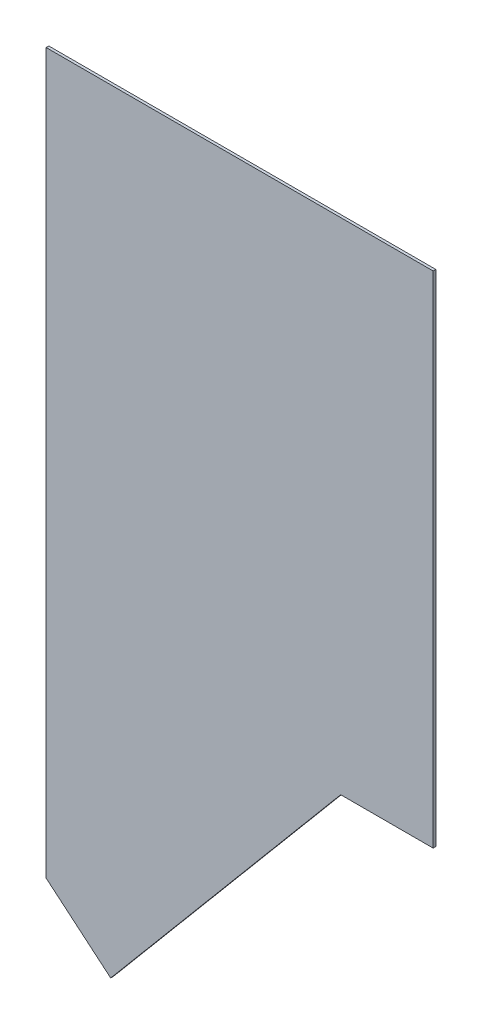
ISO-10303-21;
HEADER;
FILE_DESCRIPTION(('STEP AP214'),'2;1');
FILE_NAME('part.step','',(''),(''),'','','');
FILE_SCHEMA(('AUTOMOTIVE_DESIGN { 1 0 10303 214 1 1 1 1 }'));
ENDSEC;
DATA;
#1=APPLICATION_CONTEXT('core data for automotive mechanical design processes');
#2=APPLICATION_PROTOCOL_DEFINITION('international standard','automotive_design',2000,#1);
#3=PRODUCT_CONTEXT('',#1,'mechanical');
#4=PRODUCT('Part','Part','',(#3));
#5=PRODUCT_RELATED_PRODUCT_CATEGORY('part','',(#4));
#6=PRODUCT_DEFINITION_FORMATION('','',#4);
#7=PRODUCT_DEFINITION_CONTEXT('part definition',#1,'design');
#8=PRODUCT_DEFINITION('design','',#6,#7);
#9=PRODUCT_DEFINITION_SHAPE('','',#8);
#10=(LENGTH_UNIT() NAMED_UNIT(*) SI_UNIT(.MILLI.,.METRE.));
#11=(NAMED_UNIT(*) PLANE_ANGLE_UNIT() SI_UNIT($,.RADIAN.));
#12=(NAMED_UNIT(*) SI_UNIT($,.STERADIAN.) SOLID_ANGLE_UNIT());
#13=UNCERTAINTY_MEASURE_WITH_UNIT(LENGTH_MEASURE(1.E-05),#10,'distance_accuracy_value','');
#14=(GEOMETRIC_REPRESENTATION_CONTEXT(3) GLOBAL_UNCERTAINTY_ASSIGNED_CONTEXT((#13)) GLOBAL_UNIT_ASSIGNED_CONTEXT((#10,
#11,#12)) REPRESENTATION_CONTEXT('',''));
#15=CARTESIAN_POINT('',(0.,0.,0.));
#16=DIRECTION('',(0.,0.,1.));
#17=DIRECTION('',(1.,0.,0.));
#18=AXIS2_PLACEMENT_3D('',#15,#16,#17);
#19=CARTESIAN_POINT('',(-50.8,0.,2.1082));
#20=DIRECTION('',(1.,0.,0.));
#21=DIRECTION('',(0.,1.,0.));
#22=AXIS2_PLACEMENT_3D('',#19,#20,#21);
#23=PLANE('',#22);
#24=DIRECTION('',(0.,-1.,0.));
#25=VECTOR('',#24,1.);
#26=CARTESIAN_POINT('',(-50.8,0.,0.));
#27=LINE('',#26,#25);
#28=CARTESIAN_POINT('',(-50.8,0.,0.));
#29=VERTEX_POINT('',#28);
#30=CARTESIAN_POINT('',(-50.7999999999999,-566.618355907721,0.));
#31=VERTEX_POINT('',#30);
#32=EDGE_CURVE('E82',#29,#31,#27,.T.);
#33=ORIENTED_EDGE('',*,*,#32,.T.);
#34=DIRECTION('',(0.,0.,1.));
#35=VECTOR('',#34,1.);
#36=CARTESIAN_POINT('',(-50.7999999999999,-566.618355907721,0.));
#37=LINE('',#36,#35);
#38=CARTESIAN_POINT('',(-50.7999999999999,-566.618355907721,2.1082));
#39=VERTEX_POINT('',#38);
#40=EDGE_CURVE('E87',#31,#39,#37,.T.);
#41=ORIENTED_EDGE('',*,*,#40,.T.);
#42=DIRECTION('',(0.,-1.,0.));
#43=VECTOR('',#42,1.);
#44=CARTESIAN_POINT('',(-50.8,0.,2.1082));
#45=LINE('',#44,#43);
#46=CARTESIAN_POINT('',(-50.8,0.,2.1082));
#47=VERTEX_POINT('',#46);
#48=EDGE_CURVE('E76',#47,#39,#45,.T.);
#49=ORIENTED_EDGE('',*,*,#48,.F.);
#50=DIRECTION('',(0.,0.,-1.));
#51=VECTOR('',#50,1.);
#52=CARTESIAN_POINT('',(-50.8,0.,2.1082));
#53=LINE('',#52,#51);
#54=EDGE_CURVE('E40',#47,#29,#53,.T.);
#55=ORIENTED_EDGE('',*,*,#54,.T.);
#56=EDGE_LOOP('',(#33,#41,#49,#55));
#57=FACE_BOUND('',#56,.T.);
#58=ADVANCED_FACE('F33',(#57),#23,.F.);
#59=CARTESIAN_POINT('',(254.,0.,2.1082));
#60=DIRECTION('',(-1.,0.,0.));
#61=DIRECTION('',(0.,0.,1.));
#62=AXIS2_PLACEMENT_3D('',#59,#60,#61);
#63=PLANE('',#62);
#64=DIRECTION('',(0.,1.,0.));
#65=VECTOR('',#64,1.);
#66=CARTESIAN_POINT('',(254.,0.,2.1082));
#67=LINE('',#66,#65);
#68=CARTESIAN_POINT('',(254.,-393.7,2.1082));
#69=VERTEX_POINT('',#68);
#70=CARTESIAN_POINT('',(254.,0.,2.1082));
#71=VERTEX_POINT('',#70);
#72=EDGE_CURVE('E94',#69,#71,#67,.T.);
#73=ORIENTED_EDGE('',*,*,#72,.F.);
#74=DIRECTION('',(0.,0.,1.));
#75=VECTOR('',#74,1.);
#76=CARTESIAN_POINT('',(254.,-393.7,0.));
#77=LINE('',#76,#75);
#78=CARTESIAN_POINT('',(254.,-393.7,0.));
#79=VERTEX_POINT('',#78);
#80=EDGE_CURVE('E97',#79,#69,#77,.T.);
#81=ORIENTED_EDGE('',*,*,#80,.F.);
#82=DIRECTION('',(0.,1.,0.));
#83=VECTOR('',#82,1.);
#84=CARTESIAN_POINT('',(254.,0.,0.));
#85=LINE('',#84,#83);
#86=CARTESIAN_POINT('',(254.,0.,0.));
#87=VERTEX_POINT('',#86);
#88=EDGE_CURVE('E77',#79,#87,#85,.T.);
#89=ORIENTED_EDGE('',*,*,#88,.T.);
#90=DIRECTION('',(0.,0.,-1.));
#91=VECTOR('',#90,1.);
#92=CARTESIAN_POINT('',(254.,0.,2.1082));
#93=LINE('',#92,#91);
#94=EDGE_CURVE('E11',#71,#87,#93,.T.);
#95=ORIENTED_EDGE('',*,*,#94,.F.);
#96=EDGE_LOOP('',(#73,#81,#89,#95));
#97=FACE_BOUND('',#96,.T.);
#98=ADVANCED_FACE('F129',(#97),#63,.F.);
#99=CARTESIAN_POINT('',(-50.8,0.,2.1082));
#100=DIRECTION('',(0.,-1.,0.));
#101=DIRECTION('',(0.,0.,-1.));
#102=AXIS2_PLACEMENT_3D('',#99,#100,#101);
#103=PLANE('',#102);
#104=DIRECTION('',(-1.,0.,0.));
#105=VECTOR('',#104,1.);
#106=CARTESIAN_POINT('',(-50.8,0.,0.));
#107=LINE('',#106,#105);
#108=EDGE_CURVE('E68',#87,#29,#107,.T.);
#109=ORIENTED_EDGE('',*,*,#108,.T.);
#110=ORIENTED_EDGE('',*,*,#54,.F.);
#111=DIRECTION('',(-1.,0.,0.));
#112=VECTOR('',#111,1.);
#113=CARTESIAN_POINT('',(-50.8,0.,2.1082));
#114=LINE('',#113,#112);
#115=EDGE_CURVE('E56',#71,#47,#114,.T.);
#116=ORIENTED_EDGE('',*,*,#115,.F.);
#117=ORIENTED_EDGE('',*,*,#94,.T.);
#118=EDGE_LOOP('',(#109,#110,#116,#117));
#119=FACE_BOUND('',#118,.T.);
#120=ADVANCED_FACE('F70',(#119),#103,.F.);
#121=CARTESIAN_POINT('',(0.,0.,2.1082));
#122=DIRECTION('',(0.,0.,1.));
#123=DIRECTION('',(1.,0.,0.));
#124=AXIS2_PLACEMENT_3D('',#121,#122,#123);
#125=PLANE('',#124);
#126=DIRECTION('',(-0.765596427278906,0.643321156606694,0.));
#127=VECTOR('',#126,1.);
#128=CARTESIAN_POINT('',(-50.7999999999999,-566.618355907721,2.1082));
#129=LINE('',#128,#127);
#130=CARTESIAN_POINT('',(0.,-609.304964140435,2.1082));
#131=VERTEX_POINT('',#130);
#132=EDGE_CURVE('E104',#131,#39,#129,.T.);
#133=ORIENTED_EDGE('',*,*,#132,.F.);
#134=DIRECTION('',(-0.643321156606694,-0.765596427278906,0.));
#135=VECTOR('',#134,1.);
#136=CARTESIAN_POINT('',(0.,-609.304964140435,2.1082));
#137=LINE('',#136,#135);
#138=CARTESIAN_POINT('',(181.170170025414,-393.7,2.1082));
#139=VERTEX_POINT('',#138);
#140=EDGE_CURVE('E108',#139,#131,#137,.T.);
#141=ORIENTED_EDGE('',*,*,#140,.F.);
#142=DIRECTION('',(-1.,0.,0.));
#143=VECTOR('',#142,1.);
#144=CARTESIAN_POINT('',(181.170170025414,-393.7,2.1082));
#145=LINE('',#144,#143);
#146=EDGE_CURVE('E111',#69,#139,#145,.T.);
#147=ORIENTED_EDGE('',*,*,#146,.F.);
#148=ORIENTED_EDGE('',*,*,#72,.T.);
#149=ORIENTED_EDGE('',*,*,#115,.T.);
#150=ORIENTED_EDGE('',*,*,#48,.T.);
#151=EDGE_LOOP('',(#133,#141,#147,#148,#149,#150));
#152=FACE_BOUND('',#151,.T.);
#153=ADVANCED_FACE('F133',(#152),#125,.T.);
#154=CARTESIAN_POINT('',(0.,0.,0.));
#155=DIRECTION('',(0.,0.,1.));
#156=DIRECTION('',(1.,0.,0.));
#157=AXIS2_PLACEMENT_3D('',#154,#155,#156);
#158=PLANE('',#157);
#159=DIRECTION('',(-0.643321156606689,-0.76559642727891,0.));
#160=VECTOR('',#159,1.);
#161=CARTESIAN_POINT('',(156.491241028871,-423.069623048748,0.));
#162=LINE('',#161,#160);
#163=CARTESIAN_POINT('',(181.170170025414,-393.7,0.));
#164=VERTEX_POINT('',#163);
#165=CARTESIAN_POINT('',(0.,-609.304964140435,0.));
#166=VERTEX_POINT('',#165);
#167=EDGE_CURVE('E47',#164,#166,#162,.T.);
#168=ORIENTED_EDGE('',*,*,#167,.T.);
#169=DIRECTION('',(-0.765596427278906,0.643321156606694,0.));
#170=VECTOR('',#169,1.);
#171=CARTESIAN_POINT('',(-50.7999999999999,-566.618355907721,0.));
#172=LINE('',#171,#170);
#173=EDGE_CURVE('E86',#166,#31,#172,.T.);
#174=ORIENTED_EDGE('',*,*,#173,.T.);
#175=ORIENTED_EDGE('',*,*,#32,.F.);
#176=ORIENTED_EDGE('',*,*,#108,.F.);
#177=ORIENTED_EDGE('',*,*,#88,.F.);
#178=DIRECTION('',(-1.,0.,0.));
#179=VECTOR('',#178,1.);
#180=CARTESIAN_POINT('',(181.170170025414,-393.7,0.));
#181=LINE('',#180,#179);
#182=EDGE_CURVE('E107',#79,#164,#181,.T.);
#183=ORIENTED_EDGE('',*,*,#182,.T.);
#184=EDGE_LOOP('',(#168,#174,#175,#176,#177,#183));
#185=FACE_BOUND('',#184,.T.);
#186=ADVANCED_FACE('F84',(#185),#158,.F.);
#187=CARTESIAN_POINT('',(-50.7999999999999,-566.618355907721,0.));
#188=DIRECTION('',(0.643321156606694,0.765596427278906,0.));
#189=DIRECTION('',(-0.765596427278906,0.643321156606694,0.));
#190=AXIS2_PLACEMENT_3D('',#187,#188,#189);
#191=PLANE('',#190);
#192=ORIENTED_EDGE('',*,*,#132,.T.);
#193=ORIENTED_EDGE('',*,*,#40,.F.);
#194=ORIENTED_EDGE('',*,*,#173,.F.);
#195=DIRECTION('',(0.,0.,1.));
#196=VECTOR('',#195,1.);
#197=CARTESIAN_POINT('',(0.,-609.304964140435,0.));
#198=LINE('',#197,#196);
#199=EDGE_CURVE('E90',#166,#131,#198,.T.);
#200=ORIENTED_EDGE('',*,*,#199,.T.);
#201=EDGE_LOOP('',(#192,#193,#194,#200));
#202=FACE_BOUND('',#201,.T.);
#203=ADVANCED_FACE('F141',(#202),#191,.F.);
#204=CARTESIAN_POINT('',(0.,-609.304964140435,0.));
#205=DIRECTION('',(-0.765596427278906,0.643321156606694,0.));
#206=DIRECTION('',(-0.643321156606694,-0.765596427278906,0.));
#207=AXIS2_PLACEMENT_3D('',#204,#205,#206);
#208=PLANE('',#207);
#209=ORIENTED_EDGE('',*,*,#140,.T.);
#210=ORIENTED_EDGE('',*,*,#199,.F.);
#211=ORIENTED_EDGE('',*,*,#167,.F.);
#212=DIRECTION('',(0.,0.,1.));
#213=VECTOR('',#212,1.);
#214=CARTESIAN_POINT('',(181.170170025414,-393.7,0.));
#215=LINE('',#214,#213);
#216=EDGE_CURVE('E100',#164,#139,#215,.T.);
#217=ORIENTED_EDGE('',*,*,#216,.T.);
#218=EDGE_LOOP('',(#209,#210,#211,#217));
#219=FACE_BOUND('',#218,.T.);
#220=ADVANCED_FACE('F142',(#219),#208,.F.);
#221=CARTESIAN_POINT('',(181.170170025414,-393.7,0.));
#222=DIRECTION('',(0.,1.,0.));
#223=DIRECTION('',(0.,0.,1.));
#224=AXIS2_PLACEMENT_3D('',#221,#222,#223);
#225=PLANE('',#224);
#226=ORIENTED_EDGE('',*,*,#146,.T.);
#227=ORIENTED_EDGE('',*,*,#216,.F.);
#228=ORIENTED_EDGE('',*,*,#182,.F.);
#229=ORIENTED_EDGE('',*,*,#80,.T.);
#230=EDGE_LOOP('',(#226,#227,#228,#229));
#231=FACE_BOUND('',#230,.T.);
#232=ADVANCED_FACE('F122',(#231),#225,.F.);
#233=CLOSED_SHELL('',(#58,#98,#120,#153,#186,#203,#220,#232));
#234=MANIFOLD_SOLID_BREP('B2',#233);
#235=ADVANCED_BREP_SHAPE_REPRESENTATION('',(#18,#234),#14);
#236=SHAPE_DEFINITION_REPRESENTATION(#9,#235);
ENDSEC;
END-ISO-10303-21;
